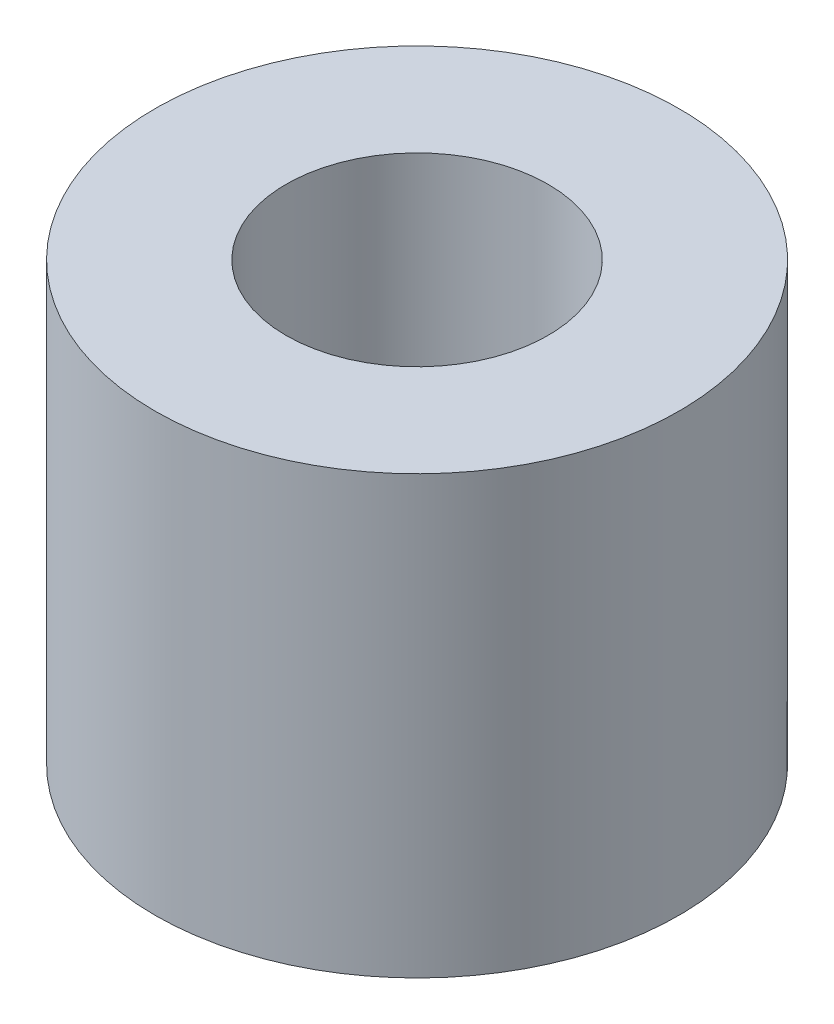
ISO-10303-21;
HEADER;
FILE_DESCRIPTION(('STEP AP214'),'2;1');
FILE_NAME('part.step','',(''),(''),'','','');
FILE_SCHEMA(('AUTOMOTIVE_DESIGN { 1 0 10303 214 1 1 1 1 }'));
ENDSEC;
DATA;
#1=APPLICATION_CONTEXT('core data for automotive mechanical design processes');
#2=APPLICATION_PROTOCOL_DEFINITION('international standard','automotive_design',2000,#1);
#3=PRODUCT_CONTEXT('',#1,'mechanical');
#4=PRODUCT('Part','Part','',(#3));
#5=PRODUCT_RELATED_PRODUCT_CATEGORY('part','',(#4));
#6=PRODUCT_DEFINITION_FORMATION('','',#4);
#7=PRODUCT_DEFINITION_CONTEXT('part definition',#1,'design');
#8=PRODUCT_DEFINITION('design','',#6,#7);
#9=PRODUCT_DEFINITION_SHAPE('','',#8);
#10=(LENGTH_UNIT() NAMED_UNIT(*) SI_UNIT(.MILLI.,.METRE.));
#11=(NAMED_UNIT(*) PLANE_ANGLE_UNIT() SI_UNIT($,.RADIAN.));
#12=(NAMED_UNIT(*) SI_UNIT($,.STERADIAN.) SOLID_ANGLE_UNIT());
#13=UNCERTAINTY_MEASURE_WITH_UNIT(LENGTH_MEASURE(1.E-05),#10,'distance_accuracy_value','');
#14=(GEOMETRIC_REPRESENTATION_CONTEXT(3) GLOBAL_UNCERTAINTY_ASSIGNED_CONTEXT((#13)) GLOBAL_UNIT_ASSIGNED_CONTEXT((#10,
#11,#12)) REPRESENTATION_CONTEXT('',''));
#15=CARTESIAN_POINT('',(0.,0.,0.));
#16=DIRECTION('',(0.,0.,1.));
#17=DIRECTION('',(1.,0.,0.));
#18=AXIS2_PLACEMENT_3D('',#15,#16,#17);
#19=CARTESIAN_POINT('',(0.,5.,0.));
#20=DIRECTION('',(0.,1.,0.));
#21=DIRECTION('',(0.,0.,1.));
#22=AXIS2_PLACEMENT_3D('',#19,#20,#21);
#23=PLANE('',#22);
#24=CARTESIAN_POINT('',(0.,5.,0.));
#25=DIRECTION('',(0.,1.,0.));
#26=DIRECTION('',(0.,0.,1.));
#27=AXIS2_PLACEMENT_3D('',#24,#25,#26);
#28=CIRCLE('',#27,3.);
#29=CARTESIAN_POINT('',(0.,5.,3.));
#30=VERTEX_POINT('',#29);
#31=EDGE_CURVE('E10',#30,#30,#28,.T.);
#32=ORIENTED_EDGE('',*,*,#31,.T.);
#33=EDGE_LOOP('',(#32));
#34=FACE_BOUND('',#33,.T.);
#35=CARTESIAN_POINT('',(0.,5.,0.));
#36=DIRECTION('',(0.,1.,0.));
#37=DIRECTION('',(0.,0.,1.));
#38=AXIS2_PLACEMENT_3D('',#35,#36,#37);
#39=CIRCLE('',#38,1.5);
#40=CARTESIAN_POINT('',(0.,5.,1.5));
#41=VERTEX_POINT('',#40);
#42=EDGE_CURVE('E42',#41,#41,#39,.T.);
#43=ORIENTED_EDGE('',*,*,#42,.F.);
#44=EDGE_LOOP('',(#43));
#45=FACE_BOUND('',#44,.T.);
#46=ADVANCED_FACE('F31',(#34,#45),#23,.T.);
#47=CARTESIAN_POINT('',(0.,0.,0.));
#48=DIRECTION('',(0.,1.,0.));
#49=DIRECTION('',(0.,0.,1.));
#50=AXIS2_PLACEMENT_3D('',#47,#48,#49);
#51=PLANE('',#50);
#52=CARTESIAN_POINT('',(0.,0.,0.));
#53=DIRECTION('',(0.,1.,0.));
#54=DIRECTION('',(0.,0.,1.));
#55=AXIS2_PLACEMENT_3D('',#52,#53,#54);
#56=CIRCLE('',#55,3.);
#57=CARTESIAN_POINT('',(0.,0.,3.));
#58=VERTEX_POINT('',#57);
#59=EDGE_CURVE('E35',#58,#58,#56,.T.);
#60=ORIENTED_EDGE('',*,*,#59,.F.);
#61=EDGE_LOOP('',(#60));
#62=FACE_BOUND('',#61,.T.);
#63=CARTESIAN_POINT('',(0.,0.,0.));
#64=DIRECTION('',(0.,1.,0.));
#65=DIRECTION('',(0.,0.,1.));
#66=AXIS2_PLACEMENT_3D('',#63,#64,#65);
#67=CIRCLE('',#66,1.5);
#68=CARTESIAN_POINT('',(0.,0.,1.5));
#69=VERTEX_POINT('',#68);
#70=EDGE_CURVE('E44',#69,#69,#67,.T.);
#71=ORIENTED_EDGE('',*,*,#70,.T.);
#72=EDGE_LOOP('',(#71));
#73=FACE_BOUND('',#72,.T.);
#74=ADVANCED_FACE('F54',(#62,#73),#51,.F.);
#75=CARTESIAN_POINT('',(0.,5.,0.));
#76=DIRECTION('',(0.,-1.,0.));
#77=DIRECTION('',(0.,0.,-1.));
#78=AXIS2_PLACEMENT_3D('',#75,#76,#77);
#79=CYLINDRICAL_SURFACE('',#78,3.);
#80=ORIENTED_EDGE('',*,*,#31,.F.);
#81=EDGE_LOOP('',(#80));
#82=FACE_BOUND('',#81,.T.);
#83=ORIENTED_EDGE('',*,*,#59,.T.);
#84=EDGE_LOOP('',(#83));
#85=FACE_BOUND('',#84,.T.);
#86=ADVANCED_FACE('F33',(#82,#85),#79,.T.);
#87=CARTESIAN_POINT('',(0.,5.,0.));
#88=DIRECTION('',(0.,-1.,0.));
#89=DIRECTION('',(0.,0.,-1.));
#90=AXIS2_PLACEMENT_3D('',#87,#88,#89);
#91=CYLINDRICAL_SURFACE('',#90,1.5);
#92=ORIENTED_EDGE('',*,*,#42,.T.);
#93=EDGE_LOOP('',(#92));
#94=FACE_BOUND('',#93,.T.);
#95=ORIENTED_EDGE('',*,*,#70,.F.);
#96=EDGE_LOOP('',(#95));
#97=FACE_BOUND('',#96,.T.);
#98=ADVANCED_FACE('F50',(#94,#97),#91,.F.);
#99=CLOSED_SHELL('',(#46,#74,#86,#98));
#100=MANIFOLD_SOLID_BREP('B2',#99);
#101=ADVANCED_BREP_SHAPE_REPRESENTATION('',(#18,#100),#14);
#102=SHAPE_DEFINITION_REPRESENTATION(#9,#101);
ENDSEC;
END-ISO-10303-21;
